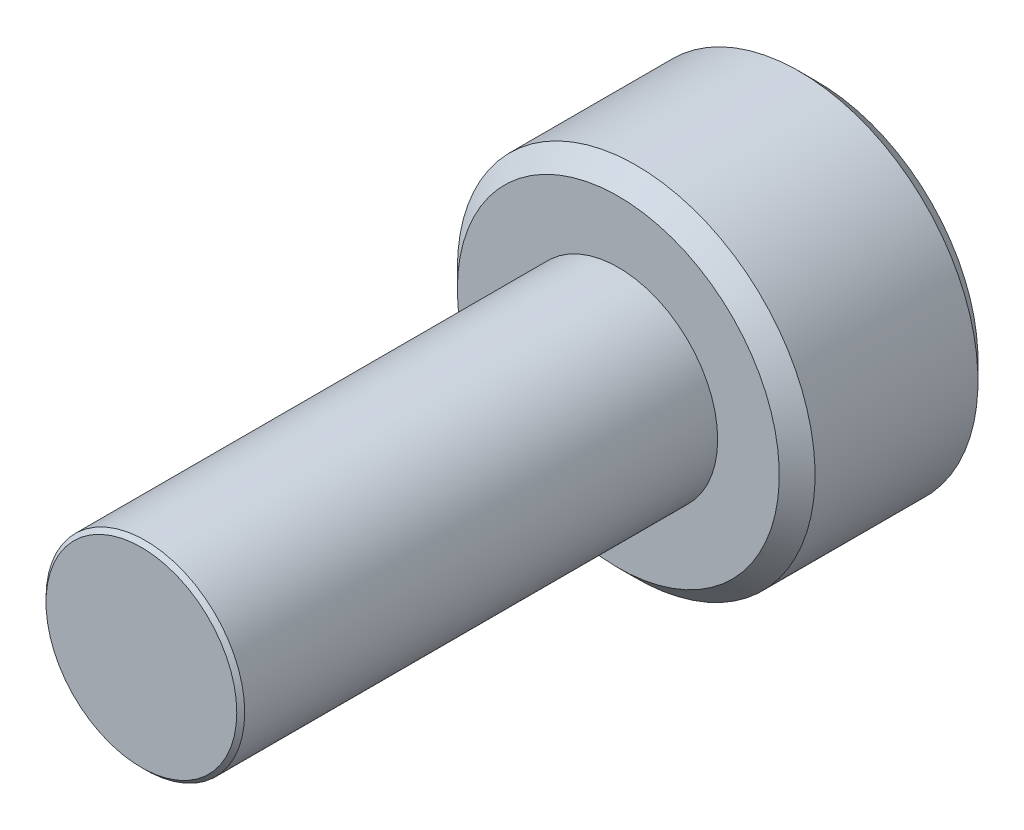
ISO-10303-21;
HEADER;
FILE_DESCRIPTION(('STEP AP214'),'2;1');
FILE_NAME('part.step','',(''),(''),'','','');
FILE_SCHEMA(('AUTOMOTIVE_DESIGN { 1 0 10303 214 1 1 1 1 }'));
ENDSEC;
DATA;
#1=APPLICATION_CONTEXT('core data for automotive mechanical design processes');
#2=APPLICATION_PROTOCOL_DEFINITION('international standard','automotive_design',2000,#1);
#3=PRODUCT_CONTEXT('',#1,'mechanical');
#4=PRODUCT('Part','Part','',(#3));
#5=PRODUCT_RELATED_PRODUCT_CATEGORY('part','',(#4));
#6=PRODUCT_DEFINITION_FORMATION('','',#4);
#7=PRODUCT_DEFINITION_CONTEXT('part definition',#1,'design');
#8=PRODUCT_DEFINITION('design','',#6,#7);
#9=PRODUCT_DEFINITION_SHAPE('','',#8);
#10=(LENGTH_UNIT() NAMED_UNIT(*) SI_UNIT(.MILLI.,.METRE.));
#11=(NAMED_UNIT(*) PLANE_ANGLE_UNIT() SI_UNIT($,.RADIAN.));
#12=(NAMED_UNIT(*) SI_UNIT($,.STERADIAN.) SOLID_ANGLE_UNIT());
#13=UNCERTAINTY_MEASURE_WITH_UNIT(LENGTH_MEASURE(1.E-05),#10,'distance_accuracy_value','');
#14=(GEOMETRIC_REPRESENTATION_CONTEXT(3) GLOBAL_UNCERTAINTY_ASSIGNED_CONTEXT((#13)) GLOBAL_UNIT_ASSIGNED_CONTEXT((#10,
#11,#12)) REPRESENTATION_CONTEXT('',''));
#15=CARTESIAN_POINT('',(0.,0.,0.));
#16=DIRECTION('',(0.,0.,1.));
#17=DIRECTION('',(1.,0.,0.));
#18=AXIS2_PLACEMENT_3D('',#15,#16,#17);
#19=CARTESIAN_POINT('',(0.,0.,-6.));
#20=DIRECTION('',(0.,0.,-1.));
#21=DIRECTION('',(-1.,0.,0.));
#22=AXIS2_PLACEMENT_3D('',#19,#20,#21);
#23=PLANE('',#22);
#24=CARTESIAN_POINT('',(0.,0.,-6.));
#25=DIRECTION('',(0.,0.,-1.));
#26=DIRECTION('',(-1.,0.,0.));
#27=AXIS2_PLACEMENT_3D('',#24,#25,#26);
#28=CIRCLE('',#27,2.025);
#29=CARTESIAN_POINT('',(-2.025,0.,-6.));
#30=VERTEX_POINT('',#29);
#31=EDGE_CURVE('E11',#30,#30,#28,.F.);
#32=ORIENTED_EDGE('',*,*,#31,.T.);
#33=EDGE_LOOP('',(#32));
#34=FACE_BOUND('',#33,.T.);
#35=CARTESIAN_POINT('',(0.,0.,-6.));
#36=DIRECTION('',(0.,0.,1.));
#37=DIRECTION('',(1.,0.,0.));
#38=AXIS2_PLACEMENT_3D('',#35,#36,#37);
#39=CIRCLE('',#38,1.25);
#40=CARTESIAN_POINT('',(1.25,0.,-6.));
#41=VERTEX_POINT('',#40);
#42=EDGE_CURVE('E118',#41,#41,#39,.T.);
#43=ORIENTED_EDGE('',*,*,#42,.F.);
#44=EDGE_LOOP('',(#43));
#45=FACE_BOUND('',#44,.T.);
#46=ADVANCED_FACE('F41',(#34,#45),#23,.F.);
#47=CARTESIAN_POINT('',(0.,0.,-6.));
#48=DIRECTION('',(0.,0.,1.));
#49=DIRECTION('',(1.,0.,0.));
#50=AXIS2_PLACEMENT_3D('',#47,#48,#49);
#51=CYLINDRICAL_SURFACE('',#50,1.25);
#52=ORIENTED_EDGE('',*,*,#42,.T.);
#53=EDGE_LOOP('',(#52));
#54=FACE_BOUND('',#53,.T.);
#55=CARTESIAN_POINT('',(0.,0.,-0.0500000000000001));
#56=DIRECTION('',(0.,0.,1.));
#57=DIRECTION('',(1.,0.,0.));
#58=AXIS2_PLACEMENT_3D('',#55,#56,#57);
#59=CIRCLE('',#58,1.25);
#60=CARTESIAN_POINT('',(1.25,0.,-0.0500000000000001));
#61=VERTEX_POINT('',#60);
#62=EDGE_CURVE('E146',#61,#61,#59,.F.);
#63=ORIENTED_EDGE('',*,*,#62,.T.);
#64=EDGE_LOOP('',(#63));
#65=FACE_BOUND('',#64,.T.);
#66=ADVANCED_FACE('F211',(#54,#65),#51,.T.);
#67=CARTESIAN_POINT('',(0.,0.,-8.5));
#68=DIRECTION('',(0.,0.,1.));
#69=DIRECTION('',(1.,0.,0.));
#70=AXIS2_PLACEMENT_3D('',#67,#68,#69);
#71=CYLINDRICAL_SURFACE('',#70,2.25);
#72=CARTESIAN_POINT('',(0.,0.,-8.275));
#73=DIRECTION('',(0.,0.,-1.));
#74=DIRECTION('',(-1.,0.,0.));
#75=AXIS2_PLACEMENT_3D('',#72,#73,#74);
#76=CIRCLE('',#75,2.25);
#77=CARTESIAN_POINT('',(-2.25,0.,-8.275));
#78=VERTEX_POINT('',#77);
#79=EDGE_CURVE('E50',#78,#78,#76,.F.);
#80=ORIENTED_EDGE('',*,*,#79,.T.);
#81=EDGE_LOOP('',(#80));
#82=FACE_BOUND('',#81,.T.);
#83=CARTESIAN_POINT('',(0.,0.,-6.225));
#84=DIRECTION('',(0.,0.,-1.));
#85=DIRECTION('',(-1.,0.,0.));
#86=AXIS2_PLACEMENT_3D('',#83,#84,#85);
#87=CIRCLE('',#86,2.25);
#88=CARTESIAN_POINT('',(-2.25,0.,-6.225));
#89=VERTEX_POINT('',#88);
#90=EDGE_CURVE('E190',#89,#89,#87,.T.);
#91=ORIENTED_EDGE('',*,*,#90,.T.);
#92=EDGE_LOOP('',(#91));
#93=FACE_BOUND('',#92,.T.);
#94=ADVANCED_FACE('F197',(#82,#93),#71,.T.);
#95=CARTESIAN_POINT('',(0.,0.,-8.5));
#96=DIRECTION('',(0.,0.,-1.));
#97=DIRECTION('',(-1.,0.,0.));
#98=AXIS2_PLACEMENT_3D('',#95,#96,#97);
#99=PLANE('',#98);
#100=CARTESIAN_POINT('',(0.,0.,-8.5));
#101=DIRECTION('',(0.,0.,-1.));
#102=DIRECTION('',(-1.,0.,0.));
#103=AXIS2_PLACEMENT_3D('',#100,#101,#102);
#104=CIRCLE('',#103,2.025);
#105=CARTESIAN_POINT('',(-2.025,0.,-8.5));
#106=VERTEX_POINT('',#105);
#107=EDGE_CURVE('E117',#106,#106,#104,.T.);
#108=ORIENTED_EDGE('',*,*,#107,.T.);
#109=EDGE_LOOP('',(#108));
#110=FACE_BOUND('',#109,.T.);
#111=CARTESIAN_POINT('',(0.,0.,-8.5));
#112=DIRECTION('',(0.,0.,-1.));
#113=DIRECTION('',(-1.,0.,0.));
#114=AXIS2_PLACEMENT_3D('',#111,#112,#113);
#115=CIRCLE('',#114,1.15470053837925);
#116=CARTESIAN_POINT('',(-1.,0.577350269189626,-8.5));
#117=VERTEX_POINT('',#116);
#118=CARTESIAN_POINT('',(0.,1.15470053837925,-8.5));
#119=VERTEX_POINT('',#118);
#120=EDGE_CURVE('E96',#117,#119,#115,.T.);
#121=ORIENTED_EDGE('',*,*,#120,.F.);
#122=CARTESIAN_POINT('',(-1.,-0.577350269189626,-8.5));
#123=VERTEX_POINT('',#122);
#124=EDGE_CURVE('E56',#123,#117,#115,.T.);
#125=ORIENTED_EDGE('',*,*,#124,.F.);
#126=CARTESIAN_POINT('',(0.,-1.15470053837925,-8.5));
#127=VERTEX_POINT('',#126);
#128=EDGE_CURVE('E241',#127,#123,#115,.T.);
#129=ORIENTED_EDGE('',*,*,#128,.F.);
#130=CARTESIAN_POINT('',(1.,-0.577350269189626,-8.5));
#131=VERTEX_POINT('',#130);
#132=EDGE_CURVE('E63',#131,#127,#115,.T.);
#133=ORIENTED_EDGE('',*,*,#132,.F.);
#134=CARTESIAN_POINT('',(1.,0.577350269189626,-8.5));
#135=VERTEX_POINT('',#134);
#136=EDGE_CURVE('E141',#135,#131,#115,.T.);
#137=ORIENTED_EDGE('',*,*,#136,.F.);
#138=EDGE_CURVE('E106',#119,#135,#115,.T.);
#139=ORIENTED_EDGE('',*,*,#138,.F.);
#140=EDGE_LOOP('',(#121,#125,#129,#133,#137,#139));
#141=FACE_BOUND('',#140,.T.);
#142=ADVANCED_FACE('F140',(#110,#141),#99,.T.);
#143=CARTESIAN_POINT('',(0.,0.,-8.5));
#144=DIRECTION('',(0.,0.,-1.));
#145=DIRECTION('',(-1.,0.,0.));
#146=AXIS2_PLACEMENT_3D('',#143,#144,#145);
#147=CONICAL_SURFACE('',#146,1.15470053837925,0.78539816339745);
#148=ORIENTED_EDGE('',*,*,#138,.T.);
#149=CARTESIAN_POINT('',(-0.000200000000000231,1.15481600843309,-8.50011548737262));
#150=CARTESIAN_POINT('',(0.0341825950071802,1.13496520795026,-8.48027793082573));
#151=CARTESIAN_POINT('',(0.0691401181398241,1.11478247255942,-8.46160502063889));
#152=CARTESIAN_POINT('',(0.140422802956089,1.07362739529219,-8.42741474272316));
#153=CARTESIAN_POINT('',(0.176754750528984,1.0526511355808,-8.41191640902346));
#154=CARTESIAN_POINT('',(0.250016613803311,1.01035337909803,-8.38536730714227));
#155=CARTESIAN_POINT('',(0.286927851445414,0.989042666109241,-8.37424977399693));
#156=CARTESIAN_POINT('',(0.361562729310859,0.945952199282691,-8.35711986577618));
#157=CARTESIAN_POINT('',(0.399284088108636,0.924173762626596,-8.35109469746667));
#158=CARTESIAN_POINT('',(0.464292198417934,0.886641312640014,-8.34566055496749));
#159=CARTESIAN_POINT('',(0.491494371528172,0.870936130672275,-8.34485693831673));
#160=CARTESIAN_POINT('',(0.545846040669112,0.839556179862848,-8.34620669941689));
#161=CARTESIAN_POINT('',(0.572995523754876,0.823881418494923,-8.3483607295472));
#162=CARTESIAN_POINT('',(0.654056277326961,0.777080970599366,-8.35911697212847));
#163=CARTESIAN_POINT('',(0.707564140978428,0.74618819111643,-8.37201455641536));
#164=CARTESIAN_POINT('',(0.801476065143432,0.691968116419649,-8.40314073060218));
#165=CARTESIAN_POINT('',(0.842320523671835,0.668386557293371,-8.41973779770184));
#166=CARTESIAN_POINT('',(0.922409637381944,0.622147085933681,-8.45712492468529));
#167=CARTESIAN_POINT('',(0.961659010870438,0.599486449584575,-8.4779013418174));
#168=CARTESIAN_POINT('',(1.0002,0.577234799135788,-8.50011548737262));
#169=B_SPLINE_CURVE_WITH_KNOTS('',3,(#149,#150,#151,#152,#153,#154,#155,#156,#157,#158,#159,
#160,#161,#162,#163,#164,#165,#166,#167,#168),.UNSPECIFIED.,.F.,.F.,(4,2,2,2,2,2,2,2,2,4),(0.,
0.133237676828558,0.26725222983449,0.3991370762693,0.530689603280769,0.624814864263847,
0.718960890149134,0.907306626112098,1.0571010036179,1.20641411519286),.UNSPECIFIED.);
#170=EDGE_CURVE('E111',#119,#135,#169,.T.);
#171=ORIENTED_EDGE('',*,*,#170,.F.);
#172=EDGE_LOOP('',(#148,#171));
#173=FACE_BOUND('',#172,.T.);
#174=ADVANCED_FACE('F112',(#173),#147,.F.);
#175=ORIENTED_EDGE('',*,*,#136,.T.);
#176=CARTESIAN_POINT('',(1.,-1.15147208646462,-8.87038567751386));
#177=CARTESIAN_POINT('',(1.,-1.12343447988552,-8.84921991987371));
#178=CARTESIAN_POINT('',(1.,-1.09524064850697,-8.82826169217591));
#179=CARTESIAN_POINT('',(1.,-1.03847715644376,-8.78684602223562));
#180=CARTESIAN_POINT('',(1.,-1.00990740382975,-8.76638870612366));
#181=CARTESIAN_POINT('',(1.,-0.923120894333477,-8.70560479495451));
#182=CARTESIAN_POINT('',(1.,-0.86425317375906,-8.6661922289614));
#183=CARTESIAN_POINT('',(1.,-0.740809858258045,-8.58882066420021));
#184=CARTESIAN_POINT('',(1.,-0.676100255137806,-8.55107303911434));
#185=CARTESIAN_POINT('',(1.,-0.543448939049123,-8.48202458755129));
#186=CARTESIAN_POINT('',(1.,-0.475519112027778,-8.45070202784687));
#187=CARTESIAN_POINT('',(1.,-0.373555850333528,-8.4123817788838));
#188=CARTESIAN_POINT('',(1.,-0.341031989670907,-8.40138359164216));
#189=CARTESIAN_POINT('',(1.,-0.275199079052293,-8.38199834214736));
#190=CARTESIAN_POINT('',(1.,-0.241889975173933,-8.3736114597767));
#191=CARTESIAN_POINT('',(1.,-0.175247517042993,-8.36002522071902));
#192=CARTESIAN_POINT('',(1.,-0.141925568218175,-8.35477079076797));
#193=CARTESIAN_POINT('',(1.,-0.0749144362322793,-8.34754868657089));
#194=CARTESIAN_POINT('',(1.,-0.0412251978501623,-8.34558151361051));
#195=CARTESIAN_POINT('',(1.,0.0249580992634204,-8.34508319839316));
#196=CARTESIAN_POINT('',(1.,0.0574512826460387,-8.34643026788864));
#197=CARTESIAN_POINT('',(1.,0.122148505701866,-8.35221648449898));
#198=CARTESIAN_POINT('',(1.,0.154352610132926,-8.35665492066154));
#199=CARTESIAN_POINT('',(1.,0.218799898867639,-8.3684568301452));
#200=CARTESIAN_POINT('',(1.,0.251033743268953,-8.37587054103851));
#201=CARTESIAN_POINT('',(1.,0.314797132354918,-8.39322894249868));
#202=CARTESIAN_POINT('',(1.,0.346326735731004,-8.40317342128883));
#203=CARTESIAN_POINT('',(1.,0.445594187730203,-8.43822348255434));
#204=CARTESIAN_POINT('',(1.,0.511919139476035,-8.46732085835672));
#205=CARTESIAN_POINT('',(1.,0.64145324465753,-8.5320153296865));
#206=CARTESIAN_POINT('',(1.,0.704650133126342,-8.56763577671524));
#207=CARTESIAN_POINT('',(1.,0.825428490174983,-8.64112390134693));
#208=CARTESIAN_POINT('',(1.,0.883132947867681,-8.67879194713546));
#209=CARTESIAN_POINT('',(1.,0.968148853704562,-8.73702285294316));
#210=CARTESIAN_POINT('',(1.,0.996120570380282,-8.75663847576286));
#211=CARTESIAN_POINT('',(1.,1.05168177729901,-8.79638851706127));
#212=CARTESIAN_POINT('',(1.,1.079271369977,-8.81652279219883));
#213=CARTESIAN_POINT('',(1.,1.10670185346329,-8.83687211907297));
#214=B_SPLINE_CURVE_WITH_KNOTS('',3,(#176,#177,#178,#179,#180,#181,#182,#183,#184,#185,#186,
#187,#188,#189,#190,#191,#192,#193,#194,#195,#196,#197,#198,#199,#200,#201,#202,#203,#204,#205,
#206,#207,#208,#209,#210,#211,#212,#213),.UNSPECIFIED.,.F.,.F.,(4,2,2,2,2,2,2,2,2,2,2,2,2,2,2,2,
2,2,4),(0.,0.10538645908329,0.210799187330123,0.423233611565469,0.647793540908504,
0.87158087773861,0.974493074181421,1.07741235827201,1.17846428203205,1.27953161415762,
1.3769408673961,1.47432772585408,1.57343322804293,1.67253043972851,1.88917353996827,
2.10660791038813,2.31323734249843,2.41572589232044,2.51818641476503),.UNSPECIFIED.);
#215=EDGE_CURVE('E105',#135,#131,#214,.F.);
#216=ORIENTED_EDGE('',*,*,#215,.F.);
#217=EDGE_LOOP('',(#175,#216));
#218=FACE_BOUND('',#217,.T.);
#219=ADVANCED_FACE('F210',(#218),#147,.F.);
#220=ORIENTED_EDGE('',*,*,#132,.T.);
#221=CARTESIAN_POINT('',(1.0002,-0.577234799135788,-8.50011548737262));
#222=CARTESIAN_POINT('',(0.965817404992819,-0.597085599618622,-8.48027793082573));
#223=CARTESIAN_POINT('',(0.930859881860175,-0.617268335009456,-8.46160502063889));
#224=CARTESIAN_POINT('',(0.85957719704391,-0.658423412276686,-8.42741474272316));
#225=CARTESIAN_POINT('',(0.823245249471016,-0.67939967198808,-8.41191640902346));
#226=CARTESIAN_POINT('',(0.749983386196688,-0.721697428470847,-8.38536730714227));
#227=CARTESIAN_POINT('',(0.713072148554585,-0.743008141459637,-8.37424977399693));
#228=CARTESIAN_POINT('',(0.63843727068914,-0.786098608286187,-8.35711986577618));
#229=CARTESIAN_POINT('',(0.600715911891363,-0.807877044942282,-8.35109469746667));
#230=CARTESIAN_POINT('',(0.535707801582066,-0.845409494928863,-8.34566055496749));
#231=CARTESIAN_POINT('',(0.508505628471827,-0.861114676896602,-8.34485693831673));
#232=CARTESIAN_POINT('',(0.454153959330887,-0.89249462770603,-8.34620669941689));
#233=CARTESIAN_POINT('',(0.427004476245123,-0.908169389073954,-8.3483607295472));
#234=CARTESIAN_POINT('',(0.345943722673039,-0.954969836969511,-8.35911697212847));
#235=CARTESIAN_POINT('',(0.292435859021571,-0.985862616452448,-8.37201455641536));
#236=CARTESIAN_POINT('',(0.198523934856567,-1.04008269114923,-8.40314073060218));
#237=CARTESIAN_POINT('',(0.157679476328165,-1.06366425027551,-8.41973779770184));
#238=CARTESIAN_POINT('',(0.0775903626180557,-1.1099037216352,-8.4571249246853));
#239=CARTESIAN_POINT('',(0.0383409891295619,-1.1325643579843,-8.47790134181741));
#240=CARTESIAN_POINT('',(-0.000200000000000337,-1.15481600843309,-8.50011548737262));
#241=B_SPLINE_CURVE_WITH_KNOTS('',3,(#221,#222,#223,#224,#225,#226,#227,#228,#229,#230,#231,
#232,#233,#234,#235,#236,#237,#238,#239,#240),.UNSPECIFIED.,.F.,.F.,(4,2,2,2,2,2,2,2,2,4),(0.,
0.13323767682856,0.267252229834491,0.399137076269301,0.53068960328077,0.624814864263847,
0.718960890149134,0.907306626112099,1.0571010036179,1.20641411519286),.UNSPECIFIED.);
#242=EDGE_CURVE('E157',#131,#127,#241,.T.);
#243=ORIENTED_EDGE('',*,*,#242,.F.);
#244=EDGE_LOOP('',(#220,#243));
#245=FACE_BOUND('',#244,.T.);
#246=ADVANCED_FACE('F363',(#245),#147,.F.);
#247=ORIENTED_EDGE('',*,*,#128,.T.);
#248=CARTESIAN_POINT('',(0.000200000000000252,-1.15481600843309,-8.50011548737262));
#249=CARTESIAN_POINT('',(-0.03418259500718,-1.13496520795026,-8.48027793082573));
#250=CARTESIAN_POINT('',(-0.069140118139824,-1.11478247255942,-8.46160502063889));
#251=CARTESIAN_POINT('',(-0.140422802956089,-1.07362739529219,-8.42741474272316));
#252=CARTESIAN_POINT('',(-0.176754750528984,-1.0526511355808,-8.41191640902346));
#253=CARTESIAN_POINT('',(-0.250016613803311,-1.01035337909803,-8.38536730714227));
#254=CARTESIAN_POINT('',(-0.286927851445414,-0.989042666109241,-8.37424977399693));
#255=CARTESIAN_POINT('',(-0.361562729310859,-0.945952199282691,-8.35711986577618));
#256=CARTESIAN_POINT('',(-0.399284088108636,-0.924173762626596,-8.35109469746667));
#257=CARTESIAN_POINT('',(-0.464292198417934,-0.886641312640014,-8.34566055496749));
#258=CARTESIAN_POINT('',(-0.491494371528173,-0.870936130672275,-8.34485693831673));
#259=CARTESIAN_POINT('',(-0.545846040669113,-0.839556179862848,-8.34620669941689));
#260=CARTESIAN_POINT('',(-0.572995523754876,-0.823881418494923,-8.3483607295472));
#261=CARTESIAN_POINT('',(-0.654056277326961,-0.777080970599366,-8.35911697212847));
#262=CARTESIAN_POINT('',(-0.707564140978428,-0.74618819111643,-8.37201455641536));
#263=CARTESIAN_POINT('',(-0.801476065143432,-0.691968116419649,-8.40314073060218));
#264=CARTESIAN_POINT('',(-0.842320523671835,-0.668386557293371,-8.41973779770184));
#265=CARTESIAN_POINT('',(-0.922409637381944,-0.622147085933681,-8.45712492468529));
#266=CARTESIAN_POINT('',(-0.961659010870438,-0.599486449584575,-8.4779013418174));
#267=CARTESIAN_POINT('',(-1.0002,-0.577234799135788,-8.50011548737262));
#268=B_SPLINE_CURVE_WITH_KNOTS('',3,(#248,#249,#250,#251,#252,#253,#254,#255,#256,#257,#258,
#259,#260,#261,#262,#263,#264,#265,#266,#267),.UNSPECIFIED.,.F.,.F.,(4,2,2,2,2,2,2,2,2,4),(0.,
0.133237676828558,0.26725222983449,0.3991370762693,0.530689603280769,0.624814864263847,
0.718960890149134,0.907306626112099,1.0571010036179,1.20641411519286),.UNSPECIFIED.);
#269=EDGE_CURVE('E249',#127,#123,#268,.T.);
#270=ORIENTED_EDGE('',*,*,#269,.F.);
#271=EDGE_LOOP('',(#247,#270));
#272=FACE_BOUND('',#271,.T.);
#273=ADVANCED_FACE('F247',(#272),#147,.F.);
#274=ORIENTED_EDGE('',*,*,#124,.T.);
#275=CARTESIAN_POINT('',(-1.,-1.15147208663215,-8.87038567764035));
#276=CARTESIAN_POINT('',(-1.,-1.12343448004835,-8.84921991999533));
#277=CARTESIAN_POINT('',(-1.,-1.09524064866509,-8.82826169229267));
#278=CARTESIAN_POINT('',(-1.,-1.0384771565924,-8.78684602234268));
#279=CARTESIAN_POINT('',(-1.,-1.00990740397363,-8.76638870622588));
#280=CARTESIAN_POINT('',(-1.,-0.923120894462776,-8.70560479504213));
#281=CARTESIAN_POINT('',(-1.,-0.864253173878446,-8.66619222903932));
#282=CARTESIAN_POINT('',(-1.,-0.740809858355812,-8.58882066425819));
#283=CARTESIAN_POINT('',(-1.,-0.67610025522381,-8.55107303916216));
#284=CARTESIAN_POINT('',(-1.,-0.543448939110598,-8.48202458758025));
#285=CARTESIAN_POINT('',(-1.,-0.475519112076496,-8.45070202786713));
#286=CARTESIAN_POINT('',(-1.,-0.373555850372649,-8.4123817788976));
#287=CARTESIAN_POINT('',(-1.,-0.341031989714047,-8.40138359165622));
#288=CARTESIAN_POINT('',(-1.,-0.275199079103602,-8.38199834216111));
#289=CARTESIAN_POINT('',(-1.,-0.241889975229392,-8.37361145978989));
#290=CARTESIAN_POINT('',(-1.,-0.175247517106614,-8.36002522073014));
#291=CARTESIAN_POINT('',(-1.,-0.141925568285807,-8.35477079077761));
#292=CARTESIAN_POINT('',(-1.,-0.0749144363078002,-8.34754868657668));
#293=CARTESIAN_POINT('',(-1.,-0.0412251979295619,-8.34558151361391));
#294=CARTESIAN_POINT('',(-1.,0.024958099176865,-8.34508319839111));
#295=CARTESIAN_POINT('',(-1.,0.0574512825561965,-8.34643026788357));
#296=CARTESIAN_POINT('',(-1.,0.122148505605779,-8.35221648448742));
#297=CARTESIAN_POINT('',(-1.,0.154352610033881,-8.35665492064649));
#298=CARTESIAN_POINT('',(-1.,0.218799898762755,-8.36845683012285));
#299=CARTESIAN_POINT('',(-1.,0.251033743161197,-8.37587054101231));
#300=CARTESIAN_POINT('',(-1.,0.314797132241694,-8.39322894246471));
#301=CARTESIAN_POINT('',(-1.,0.346326735615184,-8.40317342125094));
#302=CARTESIAN_POINT('',(-1.,0.445594187589165,-8.43822348249794));
#303=CARTESIAN_POINT('',(-1.,0.511919139313635,-8.4673208582833));
#304=CARTESIAN_POINT('',(-1.,0.64145324445405,-8.53201532957715));
#305=CARTESIAN_POINT('',(-1.,0.704650132903151,-8.56763577658696));
#306=CARTESIAN_POINT('',(-1.,0.825428489916357,-8.64112390118245));
#307=CARTESIAN_POINT('',(-1.,0.883132947593202,-8.67879194695385));
#308=CARTESIAN_POINT('',(-1.,0.968148853406642,-8.73702285273595));
#309=CARTESIAN_POINT('',(-1.,0.99612057007466,-8.75663847554718));
#310=CARTESIAN_POINT('',(-1.,1.05168177697804,-8.79638851682867));
#311=CARTESIAN_POINT('',(-1.,1.07927136964838,-8.81652279195778));
#312=CARTESIAN_POINT('',(-1.,1.10670185312703,-8.83687211882347));
#313=B_SPLINE_CURVE_WITH_KNOTS('',3,(#275,#276,#277,#278,#279,#280,#281,#282,#283,#284,#285,
#286,#287,#288,#289,#290,#291,#292,#293,#294,#295,#296,#297,#298,#299,#300,#301,#302,#303,#304,
#305,#306,#307,#308,#309,#310,#311,#312),.UNSPECIFIED.,.F.,.F.,(4,2,2,2,2,2,2,2,2,2,2,2,2,2,2,2,
2,2,4),(0.,0.105386459103349,0.210799187370247,0.423233611646472,0.647793541035351,
0.871580877910865,0.974493074342053,1.07741235842104,1.17846428216995,1.2795316142844,
1.37694086751269,1.47432772596047,1.57343322813835,1.67253043981296,1.88917353997386,
2.10660791031433,2.31323734235672,2.41572589214523,2.51818641455632),.UNSPECIFIED.);
#314=EDGE_CURVE('E129',#123,#117,#313,.T.);
#315=ORIENTED_EDGE('',*,*,#314,.F.);
#316=EDGE_LOOP('',(#274,#315));
#317=FACE_BOUND('',#316,.T.);
#318=ADVANCED_FACE('F350',(#317),#147,.F.);
#319=ORIENTED_EDGE('',*,*,#120,.T.);
#320=CARTESIAN_POINT('',(-1.0002,0.577234799135788,-8.50011548737262));
#321=CARTESIAN_POINT('',(-0.965817404992819,0.597085599618622,-8.48027793082573));
#322=CARTESIAN_POINT('',(-0.930859881860175,0.617268335009456,-8.46160502063889));
#323=CARTESIAN_POINT('',(-0.85957719704391,0.658423412276686,-8.42741474272316));
#324=CARTESIAN_POINT('',(-0.823245249471016,0.67939967198808,-8.41191640902346));
#325=CARTESIAN_POINT('',(-0.749983386196688,0.721697428470847,-8.38536730714227));
#326=CARTESIAN_POINT('',(-0.713072148554585,0.743008141459637,-8.37424977399693));
#327=CARTESIAN_POINT('',(-0.63843727068914,0.786098608286187,-8.35711986577618));
#328=CARTESIAN_POINT('',(-0.600715911891363,0.807877044942282,-8.35109469746667));
#329=CARTESIAN_POINT('',(-0.535707801582065,0.845409494928864,-8.34566055496749));
#330=CARTESIAN_POINT('',(-0.508505628471826,0.861114676896602,-8.34485693831673));
#331=CARTESIAN_POINT('',(-0.454153959330887,0.89249462770603,-8.34620669941689));
#332=CARTESIAN_POINT('',(-0.427004476245123,0.908169389073955,-8.3483607295472));
#333=CARTESIAN_POINT('',(-0.345943722673038,0.954969836969512,-8.35911697212847));
#334=CARTESIAN_POINT('',(-0.292435859021571,0.985862616452448,-8.37201455641536));
#335=CARTESIAN_POINT('',(-0.198523934856567,1.04008269114923,-8.40314073060218));
#336=CARTESIAN_POINT('',(-0.157679476328164,1.06366425027551,-8.41973779770184));
#337=CARTESIAN_POINT('',(-0.0775903626180554,1.1099037216352,-8.4571249246853));
#338=CARTESIAN_POINT('',(-0.0383409891295616,1.1325643579843,-8.47790134181741));
#339=CARTESIAN_POINT('',(0.000200000000000518,1.15481600843309,-8.50011548737262));
#340=B_SPLINE_CURVE_WITH_KNOTS('',3,(#320,#321,#322,#323,#324,#325,#326,#327,#328,#329,#330,
#331,#332,#333,#334,#335,#336,#337,#338,#339),.UNSPECIFIED.,.F.,.F.,(4,2,2,2,2,2,2,2,2,4),(0.,
0.13323767682856,0.267252229834491,0.399137076269301,0.53068960328077,0.624814864263848,
0.718960890149135,0.9073066261121,1.0571010036179,1.20641411519286),.UNSPECIFIED.);
#341=EDGE_CURVE('E100',#117,#119,#340,.T.);
#342=ORIENTED_EDGE('',*,*,#341,.F.);
#343=EDGE_LOOP('',(#319,#342));
#344=FACE_BOUND('',#343,.T.);
#345=ADVANCED_FACE('F98',(#344),#147,.F.);
#346=CARTESIAN_POINT('',(1.,1.73205080756888,-7.));
#347=DIRECTION('',(0.,0.,-1.));
#348=DIRECTION('',(-1.,0.,0.));
#349=AXIS2_PLACEMENT_3D('',#346,#347,#348);
#350=PLANE('',#349);
#351=DIRECTION('',(0.866025403784439,0.5,0.));
#352=VECTOR('',#351,1.);
#353=CARTESIAN_POINT('',(-1.,0.577350269189626,-7.));
#354=LINE('',#353,#352);
#355=CARTESIAN_POINT('',(-1.,0.577350269189626,-7.));
#356=VERTEX_POINT('',#355);
#357=CARTESIAN_POINT('',(0.,1.15470053837925,-7.));
#358=VERTEX_POINT('',#357);
#359=EDGE_CURVE('E128',#356,#358,#354,.T.);
#360=ORIENTED_EDGE('',*,*,#359,.T.);
#361=DIRECTION('',(0.866025403784439,-0.5,0.));
#362=VECTOR('',#361,1.);
#363=CARTESIAN_POINT('',(0.,1.15470053837925,-7.));
#364=LINE('',#363,#362);
#365=CARTESIAN_POINT('',(1.,0.577350269189626,-7.));
#366=VERTEX_POINT('',#365);
#367=EDGE_CURVE('E133',#358,#366,#364,.T.);
#368=ORIENTED_EDGE('',*,*,#367,.T.);
#369=DIRECTION('',(0.,-1.,0.));
#370=VECTOR('',#369,1.);
#371=CARTESIAN_POINT('',(1.,0.577350269189626,-7.));
#372=LINE('',#371,#370);
#373=CARTESIAN_POINT('',(1.,-0.577350269189626,-7.));
#374=VERTEX_POINT('',#373);
#375=EDGE_CURVE('E277',#366,#374,#372,.T.);
#376=ORIENTED_EDGE('',*,*,#375,.T.);
#377=DIRECTION('',(-0.866025403784439,-0.5,0.));
#378=VECTOR('',#377,1.);
#379=CARTESIAN_POINT('',(1.,-0.577350269189626,-7.));
#380=LINE('',#379,#378);
#381=CARTESIAN_POINT('',(0.,-1.15470053837925,-7.));
#382=VERTEX_POINT('',#381);
#383=EDGE_CURVE('E280',#374,#382,#380,.T.);
#384=ORIENTED_EDGE('',*,*,#383,.T.);
#385=DIRECTION('',(-0.866025403784439,0.5,0.));
#386=VECTOR('',#385,1.);
#387=CARTESIAN_POINT('',(0.,-1.15470053837925,-7.));
#388=LINE('',#387,#386);
#389=CARTESIAN_POINT('',(-1.,-0.577350269189626,-7.));
#390=VERTEX_POINT('',#389);
#391=EDGE_CURVE('E263',#382,#390,#388,.T.);
#392=ORIENTED_EDGE('',*,*,#391,.T.);
#393=DIRECTION('',(0.,1.,0.));
#394=VECTOR('',#393,1.);
#395=CARTESIAN_POINT('',(-1.,-0.577350269189626,-7.));
#396=LINE('',#395,#394);
#397=EDGE_CURVE('E137',#390,#356,#396,.T.);
#398=ORIENTED_EDGE('',*,*,#397,.T.);
#399=EDGE_LOOP('',(#360,#368,#376,#384,#392,#398));
#400=FACE_BOUND('',#399,.T.);
#401=ADVANCED_FACE('F178',(#400),#350,.T.);
#402=CARTESIAN_POINT('',(0.,1.15470053837925,-7.));
#403=DIRECTION('',(0.5,0.866025403784439,0.));
#404=DIRECTION('',(-0.866025403784439,0.5,0.));
#405=AXIS2_PLACEMENT_3D('',#402,#403,#404);
#406=PLANE('',#405);
#407=DIRECTION('',(0.,0.,-1.));
#408=VECTOR('',#407,1.);
#409=CARTESIAN_POINT('',(0.,1.15470053837925,-7.));
#410=LINE('',#409,#408);
#411=EDGE_CURVE('E124',#358,#119,#410,.T.);
#412=ORIENTED_EDGE('',*,*,#411,.T.);
#413=ORIENTED_EDGE('',*,*,#170,.T.);
#414=DIRECTION('',(0.,0.,-1.));
#415=VECTOR('',#414,1.);
#416=CARTESIAN_POINT('',(1.,0.577350269189626,-7.));
#417=LINE('',#416,#415);
#418=EDGE_CURVE('E136',#366,#135,#417,.T.);
#419=ORIENTED_EDGE('',*,*,#418,.F.);
#420=ORIENTED_EDGE('',*,*,#367,.F.);
#421=EDGE_LOOP('',(#412,#413,#419,#420));
#422=FACE_BOUND('',#421,.T.);
#423=ADVANCED_FACE('F131',(#422),#406,.F.);
#424=CARTESIAN_POINT('',(1.,0.577350269189626,-7.));
#425=DIRECTION('',(1.,0.,0.));
#426=DIRECTION('',(0.,0.,-1.));
#427=AXIS2_PLACEMENT_3D('',#424,#425,#426);
#428=PLANE('',#427);
#429=ORIENTED_EDGE('',*,*,#418,.T.);
#430=ORIENTED_EDGE('',*,*,#215,.T.);
#431=DIRECTION('',(0.,0.,-1.));
#432=VECTOR('',#431,1.);
#433=CARTESIAN_POINT('',(1.,-0.577350269189626,-7.));
#434=LINE('',#433,#432);
#435=EDGE_CURVE('E259',#374,#131,#434,.T.);
#436=ORIENTED_EDGE('',*,*,#435,.F.);
#437=ORIENTED_EDGE('',*,*,#375,.F.);
#438=EDGE_LOOP('',(#429,#430,#436,#437));
#439=FACE_BOUND('',#438,.T.);
#440=ADVANCED_FACE('F167',(#439),#428,.F.);
#441=CARTESIAN_POINT('',(1.,-0.577350269189626,-7.));
#442=DIRECTION('',(0.5,-0.866025403784439,0.));
#443=DIRECTION('',(0.866025403784439,0.5,0.));
#444=AXIS2_PLACEMENT_3D('',#441,#442,#443);
#445=PLANE('',#444);
#446=ORIENTED_EDGE('',*,*,#435,.T.);
#447=ORIENTED_EDGE('',*,*,#242,.T.);
#448=DIRECTION('',(0.,0.,-1.));
#449=VECTOR('',#448,1.);
#450=CARTESIAN_POINT('',(0.,-1.15470053837925,-7.));
#451=LINE('',#450,#449);
#452=EDGE_CURVE('E257',#382,#127,#451,.T.);
#453=ORIENTED_EDGE('',*,*,#452,.F.);
#454=ORIENTED_EDGE('',*,*,#383,.F.);
#455=EDGE_LOOP('',(#446,#447,#453,#454));
#456=FACE_BOUND('',#455,.T.);
#457=ADVANCED_FACE('F171',(#456),#445,.F.);
#458=CARTESIAN_POINT('',(0.,-1.15470053837925,-7.));
#459=DIRECTION('',(-0.5,-0.866025403784439,0.));
#460=DIRECTION('',(0.866025403784439,-0.5,0.));
#461=AXIS2_PLACEMENT_3D('',#458,#459,#460);
#462=PLANE('',#461);
#463=ORIENTED_EDGE('',*,*,#452,.T.);
#464=ORIENTED_EDGE('',*,*,#269,.T.);
#465=DIRECTION('',(0.,0.,-1.));
#466=VECTOR('',#465,1.);
#467=CARTESIAN_POINT('',(-1.,-0.577350269189626,-7.));
#468=LINE('',#467,#466);
#469=EDGE_CURVE('E266',#390,#123,#468,.T.);
#470=ORIENTED_EDGE('',*,*,#469,.F.);
#471=ORIENTED_EDGE('',*,*,#391,.F.);
#472=EDGE_LOOP('',(#463,#464,#470,#471));
#473=FACE_BOUND('',#472,.T.);
#474=ADVANCED_FACE('F261',(#473),#462,.F.);
#475=CARTESIAN_POINT('',(-1.,-0.577350269189626,-7.));
#476=DIRECTION('',(-1.,0.,0.));
#477=DIRECTION('',(0.,-1.,0.));
#478=AXIS2_PLACEMENT_3D('',#475,#476,#477);
#479=PLANE('',#478);
#480=ORIENTED_EDGE('',*,*,#469,.T.);
#481=ORIENTED_EDGE('',*,*,#314,.T.);
#482=DIRECTION('',(0.,0.,-1.));
#483=VECTOR('',#482,1.);
#484=CARTESIAN_POINT('',(-1.,0.577350269189626,-7.));
#485=LINE('',#484,#483);
#486=EDGE_CURVE('E126',#356,#117,#485,.T.);
#487=ORIENTED_EDGE('',*,*,#486,.F.);
#488=ORIENTED_EDGE('',*,*,#397,.F.);
#489=EDGE_LOOP('',(#480,#481,#487,#488));
#490=FACE_BOUND('',#489,.T.);
#491=ADVANCED_FACE('F299',(#490),#479,.F.);
#492=CARTESIAN_POINT('',(-1.,0.577350269189626,-7.));
#493=DIRECTION('',(-0.5,0.866025403784439,0.));
#494=DIRECTION('',(-0.866025403784439,-0.5,0.));
#495=AXIS2_PLACEMENT_3D('',#492,#493,#494);
#496=PLANE('',#495);
#497=ORIENTED_EDGE('',*,*,#486,.T.);
#498=ORIENTED_EDGE('',*,*,#341,.T.);
#499=ORIENTED_EDGE('',*,*,#411,.F.);
#500=ORIENTED_EDGE('',*,*,#359,.F.);
#501=EDGE_LOOP('',(#497,#498,#499,#500));
#502=FACE_BOUND('',#501,.T.);
#503=ADVANCED_FACE('F122',(#502),#496,.F.);
#504=CARTESIAN_POINT('',(0.,0.,-8.5));
#505=DIRECTION('',(0.,0.,1.));
#506=DIRECTION('',(1.,0.,0.));
#507=AXIS2_PLACEMENT_3D('',#504,#505,#506);
#508=CONICAL_SURFACE('',#507,2.025,0.785398163397447);
#509=ORIENTED_EDGE('',*,*,#79,.F.);
#510=EDGE_LOOP('',(#509));
#511=FACE_BOUND('',#510,.T.);
#512=ORIENTED_EDGE('',*,*,#107,.F.);
#513=EDGE_LOOP('',(#512));
#514=FACE_BOUND('',#513,.T.);
#515=ADVANCED_FACE('F200',(#511,#514),#508,.T.);
#516=CARTESIAN_POINT('',(0.,0.,-6.225));
#517=DIRECTION('',(0.,0.,-1.));
#518=DIRECTION('',(-1.,0.,0.));
#519=AXIS2_PLACEMENT_3D('',#516,#517,#518);
#520=CONICAL_SURFACE('',#519,2.25,0.785398163397451);
#521=ORIENTED_EDGE('',*,*,#31,.F.);
#522=EDGE_LOOP('',(#521));
#523=FACE_BOUND('',#522,.T.);
#524=ORIENTED_EDGE('',*,*,#90,.F.);
#525=EDGE_LOOP('',(#524));
#526=FACE_BOUND('',#525,.T.);
#527=ADVANCED_FACE('F43',(#523,#526),#520,.T.);
#528=CARTESIAN_POINT('',(0.,0.,0.));
#529=DIRECTION('',(0.,0.,-1.));
#530=DIRECTION('',(-1.,0.,0.));
#531=AXIS2_PLACEMENT_3D('',#528,#529,#530);
#532=CONICAL_SURFACE('',#531,1.2,0.785398163397442);
#533=ORIENTED_EDGE('',*,*,#62,.F.);
#534=EDGE_LOOP('',(#533));
#535=FACE_BOUND('',#534,.T.);
#536=CARTESIAN_POINT('',(0.,0.,0.));
#537=DIRECTION('',(0.,0.,1.));
#538=DIRECTION('',(1.,0.,0.));
#539=AXIS2_PLACEMENT_3D('',#536,#537,#538);
#540=CIRCLE('',#539,1.2);
#541=CARTESIAN_POINT('',(1.2,0.,0.));
#542=VERTEX_POINT('',#541);
#543=EDGE_CURVE('E233',#542,#542,#540,.T.);
#544=ORIENTED_EDGE('',*,*,#543,.F.);
#545=EDGE_LOOP('',(#544));
#546=FACE_BOUND('',#545,.T.);
#547=ADVANCED_FACE('F225',(#535,#546),#532,.T.);
#548=CARTESIAN_POINT('',(0.,0.,0.));
#549=DIRECTION('',(0.,0.,1.));
#550=DIRECTION('',(1.,0.,0.));
#551=AXIS2_PLACEMENT_3D('',#548,#549,#550);
#552=PLANE('',#551);
#553=ORIENTED_EDGE('',*,*,#543,.T.);
#554=EDGE_LOOP('',(#553));
#555=FACE_BOUND('',#554,.T.);
#556=ADVANCED_FACE('F223',(#555),#552,.T.);
#557=CLOSED_SHELL('',(#46,#66,#94,#142,#174,#219,#246,#273,#318,#345,#401,#423,#440,#457,#474,
#491,#503,#515,#527,#547,#556));
#558=MANIFOLD_SOLID_BREP('B2',#557);
#559=ADVANCED_BREP_SHAPE_REPRESENTATION('',(#18,#558),#14);
#560=SHAPE_DEFINITION_REPRESENTATION(#9,#559);
ENDSEC;
END-ISO-10303-21;
